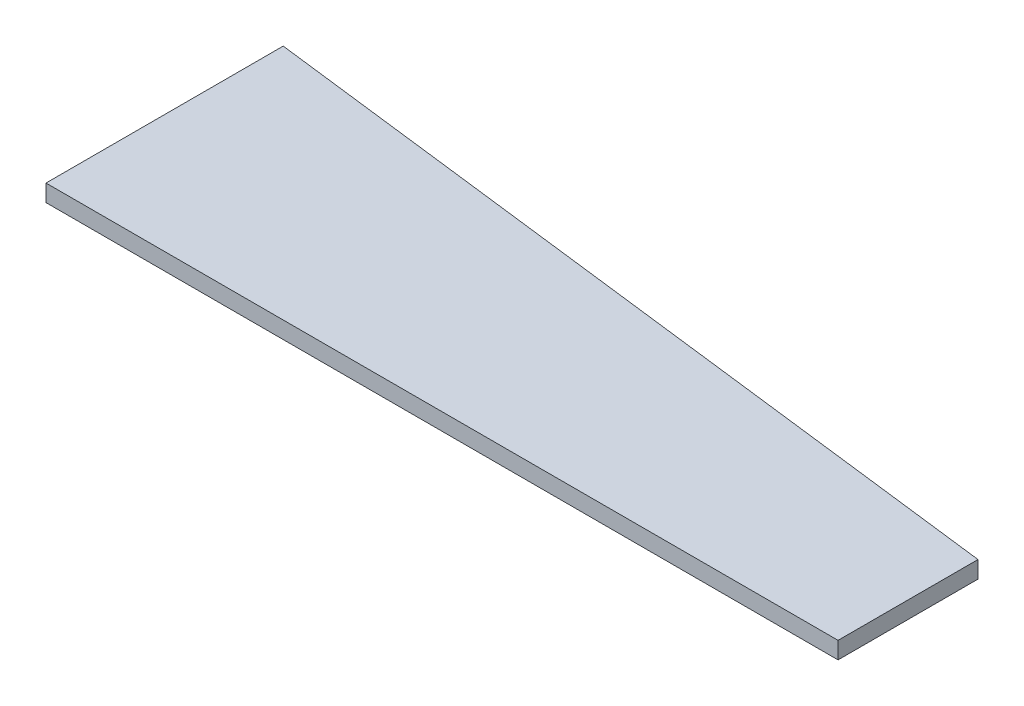
ISO-10303-21;
HEADER;
FILE_DESCRIPTION(('STEP AP214'),'2;1');
FILE_NAME('part.step','',(''),(''),'','','');
FILE_SCHEMA(('AUTOMOTIVE_DESIGN { 1 0 10303 214 1 1 1 1 }'));
ENDSEC;
DATA;
#1=APPLICATION_CONTEXT('core data for automotive mechanical design processes');
#2=APPLICATION_PROTOCOL_DEFINITION('international standard','automotive_design',2000,#1);
#3=PRODUCT_CONTEXT('',#1,'mechanical');
#4=PRODUCT('Part','Part','',(#3));
#5=PRODUCT_RELATED_PRODUCT_CATEGORY('part','',(#4));
#6=PRODUCT_DEFINITION_FORMATION('','',#4);
#7=PRODUCT_DEFINITION_CONTEXT('part definition',#1,'design');
#8=PRODUCT_DEFINITION('design','',#6,#7);
#9=PRODUCT_DEFINITION_SHAPE('','',#8);
#10=(LENGTH_UNIT() NAMED_UNIT(*) SI_UNIT(.MILLI.,.METRE.));
#11=(NAMED_UNIT(*) PLANE_ANGLE_UNIT() SI_UNIT($,.RADIAN.));
#12=(NAMED_UNIT(*) SI_UNIT($,.STERADIAN.) SOLID_ANGLE_UNIT());
#13=UNCERTAINTY_MEASURE_WITH_UNIT(LENGTH_MEASURE(1.E-05),#10,'distance_accuracy_value','');
#14=(GEOMETRIC_REPRESENTATION_CONTEXT(3) GLOBAL_UNCERTAINTY_ASSIGNED_CONTEXT((#13)) GLOBAL_UNIT_ASSIGNED_CONTEXT((#10,
#11,#12)) REPRESENTATION_CONTEXT('',''));
#15=CARTESIAN_POINT('',(0.,0.,0.));
#16=DIRECTION('',(0.,0.,1.));
#17=DIRECTION('',(1.,0.,0.));
#18=AXIS2_PLACEMENT_3D('',#15,#16,#17);
#19=CARTESIAN_POINT('',(-127.963141641098,5.7,41.3387662558041));
#20=DIRECTION('',(0.,0.,-1.));
#21=DIRECTION('',(-1.,0.,0.));
#22=AXIS2_PLACEMENT_3D('',#19,#20,#21);
#23=PLANE('',#22);
#24=DIRECTION('',(1.,0.,0.));
#25=VECTOR('',#24,1.);
#26=CARTESIAN_POINT('',(-127.963141641098,0.,41.3387662558041));
#27=LINE('',#26,#25);
#28=CARTESIAN_POINT('',(-127.963141641098,0.,41.3387662558041));
#29=VERTEX_POINT('',#28);
#30=CARTESIAN_POINT('',(138.036858358902,0.,41.3387662558041));
#31=VERTEX_POINT('',#30);
#32=EDGE_CURVE('E111',#29,#31,#27,.T.);
#33=ORIENTED_EDGE('',*,*,#32,.T.);
#34=DIRECTION('',(0.,-1.,0.));
#35=VECTOR('',#34,1.);
#36=CARTESIAN_POINT('',(138.036858358902,5.7,41.3387662558041));
#37=LINE('',#36,#35);
#38=CARTESIAN_POINT('',(138.036858358902,5.7,41.3387662558041));
#39=VERTEX_POINT('',#38);
#40=EDGE_CURVE('E11',#39,#31,#37,.T.);
#41=ORIENTED_EDGE('',*,*,#40,.F.);
#42=DIRECTION('',(1.,0.,0.));
#43=VECTOR('',#42,1.);
#44=CARTESIAN_POINT('',(-127.963141641098,5.7,41.3387662558041));
#45=LINE('',#44,#43);
#46=CARTESIAN_POINT('',(-127.963141641098,5.7,41.3387662558041));
#47=VERTEX_POINT('',#46);
#48=EDGE_CURVE('E95',#47,#39,#45,.T.);
#49=ORIENTED_EDGE('',*,*,#48,.F.);
#50=DIRECTION('',(0.,-1.,0.));
#51=VECTOR('',#50,1.);
#52=CARTESIAN_POINT('',(-127.963141641098,5.7,41.3387662558041));
#53=LINE('',#52,#51);
#54=EDGE_CURVE('E107',#47,#29,#53,.T.);
#55=ORIENTED_EDGE('',*,*,#54,.T.);
#56=EDGE_LOOP('',(#33,#41,#49,#55));
#57=FACE_BOUND('',#56,.T.);
#58=ADVANCED_FACE('F43',(#57),#23,.F.);
#59=CARTESIAN_POINT('',(138.036858358902,5.7,41.3387662558041));
#60=DIRECTION('',(-1.,0.,0.));
#61=DIRECTION('',(0.,0.,1.));
#62=AXIS2_PLACEMENT_3D('',#59,#60,#61);
#63=PLANE('',#62);
#64=DIRECTION('',(0.,0.,-1.));
#65=VECTOR('',#64,1.);
#66=CARTESIAN_POINT('',(138.036858358902,0.,41.3387662558041));
#67=LINE('',#66,#65);
#68=CARTESIAN_POINT('',(138.036858358902,0.,-5.66123374419587));
#69=VERTEX_POINT('',#68);
#70=EDGE_CURVE('E100',#31,#69,#67,.T.);
#71=ORIENTED_EDGE('',*,*,#70,.T.);
#72=DIRECTION('',(0.,-1.,0.));
#73=VECTOR('',#72,1.);
#74=CARTESIAN_POINT('',(138.036858358902,5.7,-5.66123374419587));
#75=LINE('',#74,#73);
#76=CARTESIAN_POINT('',(138.036858358902,5.7,-5.66123374419587));
#77=VERTEX_POINT('',#76);
#78=EDGE_CURVE('E52',#77,#69,#75,.T.);
#79=ORIENTED_EDGE('',*,*,#78,.F.);
#80=DIRECTION('',(0.,0.,-1.));
#81=VECTOR('',#80,1.);
#82=CARTESIAN_POINT('',(138.036858358902,5.7,41.3387662558041));
#83=LINE('',#82,#81);
#84=EDGE_CURVE('E90',#39,#77,#83,.T.);
#85=ORIENTED_EDGE('',*,*,#84,.F.);
#86=ORIENTED_EDGE('',*,*,#40,.T.);
#87=EDGE_LOOP('',(#71,#79,#85,#86));
#88=FACE_BOUND('',#87,.T.);
#89=ADVANCED_FACE('F99',(#88),#63,.F.);
#90=CARTESIAN_POINT('',(-127.963141641098,5.7,-38.3219269443666));
#91=DIRECTION('',(-0.121869343405141,0.,0.992546151641323));
#92=DIRECTION('',(0.992546151641323,0.,0.121869343405141));
#93=AXIS2_PLACEMENT_3D('',#90,#91,#92);
#94=PLANE('',#93);
#95=DIRECTION('',(-0.992546151641323,0.,-0.121869343405141));
#96=VECTOR('',#95,1.);
#97=CARTESIAN_POINT('',(-127.963141641098,0.,-38.3219269443666));
#98=LINE('',#97,#96);
#99=CARTESIAN_POINT('',(-127.963141641098,0.,-38.3219269443666));
#100=VERTEX_POINT('',#99);
#101=EDGE_CURVE('E77',#69,#100,#98,.T.);
#102=ORIENTED_EDGE('',*,*,#101,.T.);
#103=DIRECTION('',(0.,-1.,0.));
#104=VECTOR('',#103,1.);
#105=CARTESIAN_POINT('',(-127.963141641098,5.7,-38.3219269443666));
#106=LINE('',#105,#104);
#107=CARTESIAN_POINT('',(-127.963141641098,5.7,-38.3219269443666));
#108=VERTEX_POINT('',#107);
#109=EDGE_CURVE('E102',#108,#100,#106,.T.);
#110=ORIENTED_EDGE('',*,*,#109,.F.);
#111=DIRECTION('',(-0.992546151641323,0.,-0.121869343405141));
#112=VECTOR('',#111,1.);
#113=CARTESIAN_POINT('',(-127.963141641098,5.7,-38.3219269443666));
#114=LINE('',#113,#112);
#115=EDGE_CURVE('E93',#77,#108,#114,.T.);
#116=ORIENTED_EDGE('',*,*,#115,.F.);
#117=ORIENTED_EDGE('',*,*,#78,.T.);
#118=EDGE_LOOP('',(#102,#110,#116,#117));
#119=FACE_BOUND('',#118,.T.);
#120=ADVANCED_FACE('F103',(#119),#94,.F.);
#121=CARTESIAN_POINT('',(-127.963141641098,5.7,-38.3219269443666));
#122=DIRECTION('',(1.,0.,0.));
#123=DIRECTION('',(0.,0.,-1.));
#124=AXIS2_PLACEMENT_3D('',#121,#122,#123);
#125=PLANE('',#124);
#126=DIRECTION('',(0.,0.,1.));
#127=VECTOR('',#126,1.);
#128=CARTESIAN_POINT('',(-127.963141641098,0.,-38.3219269443666));
#129=LINE('',#128,#127);
#130=EDGE_CURVE('E83',#100,#29,#129,.T.);
#131=ORIENTED_EDGE('',*,*,#130,.T.);
#132=ORIENTED_EDGE('',*,*,#54,.F.);
#133=DIRECTION('',(0.,0.,1.));
#134=VECTOR('',#133,1.);
#135=CARTESIAN_POINT('',(-127.963141641098,5.7,-38.3219269443666));
#136=LINE('',#135,#134);
#137=EDGE_CURVE('E60',#108,#47,#136,.T.);
#138=ORIENTED_EDGE('',*,*,#137,.F.);
#139=ORIENTED_EDGE('',*,*,#109,.T.);
#140=EDGE_LOOP('',(#131,#132,#138,#139));
#141=FACE_BOUND('',#140,.T.);
#142=ADVANCED_FACE('F124',(#141),#125,.F.);
#143=CARTESIAN_POINT('',(0.,5.7,0.));
#144=DIRECTION('',(0.,1.,0.));
#145=DIRECTION('',(0.,0.,1.));
#146=AXIS2_PLACEMENT_3D('',#143,#144,#145);
#147=PLANE('',#146);
#148=ORIENTED_EDGE('',*,*,#48,.T.);
#149=ORIENTED_EDGE('',*,*,#84,.T.);
#150=ORIENTED_EDGE('',*,*,#115,.T.);
#151=ORIENTED_EDGE('',*,*,#137,.T.);
#152=EDGE_LOOP('',(#148,#149,#150,#151));
#153=FACE_BOUND('',#152,.T.);
#154=ADVANCED_FACE('F91',(#153),#147,.T.);
#155=CARTESIAN_POINT('',(0.,0.,0.));
#156=DIRECTION('',(0.,1.,0.));
#157=DIRECTION('',(0.,0.,1.));
#158=AXIS2_PLACEMENT_3D('',#155,#156,#157);
#159=PLANE('',#158);
#160=ORIENTED_EDGE('',*,*,#32,.F.);
#161=ORIENTED_EDGE('',*,*,#130,.F.);
#162=ORIENTED_EDGE('',*,*,#101,.F.);
#163=ORIENTED_EDGE('',*,*,#70,.F.);
#164=EDGE_LOOP('',(#160,#161,#162,#163));
#165=FACE_BOUND('',#164,.T.);
#166=ADVANCED_FACE('F127',(#165),#159,.F.);
#167=CLOSED_SHELL('',(#58,#89,#120,#142,#154,#166));
#168=MANIFOLD_SOLID_BREP('B2',#167);
#169=ADVANCED_BREP_SHAPE_REPRESENTATION('',(#18,#168),#14);
#170=SHAPE_DEFINITION_REPRESENTATION(#9,#169);
ENDSEC;
END-ISO-10303-21;
